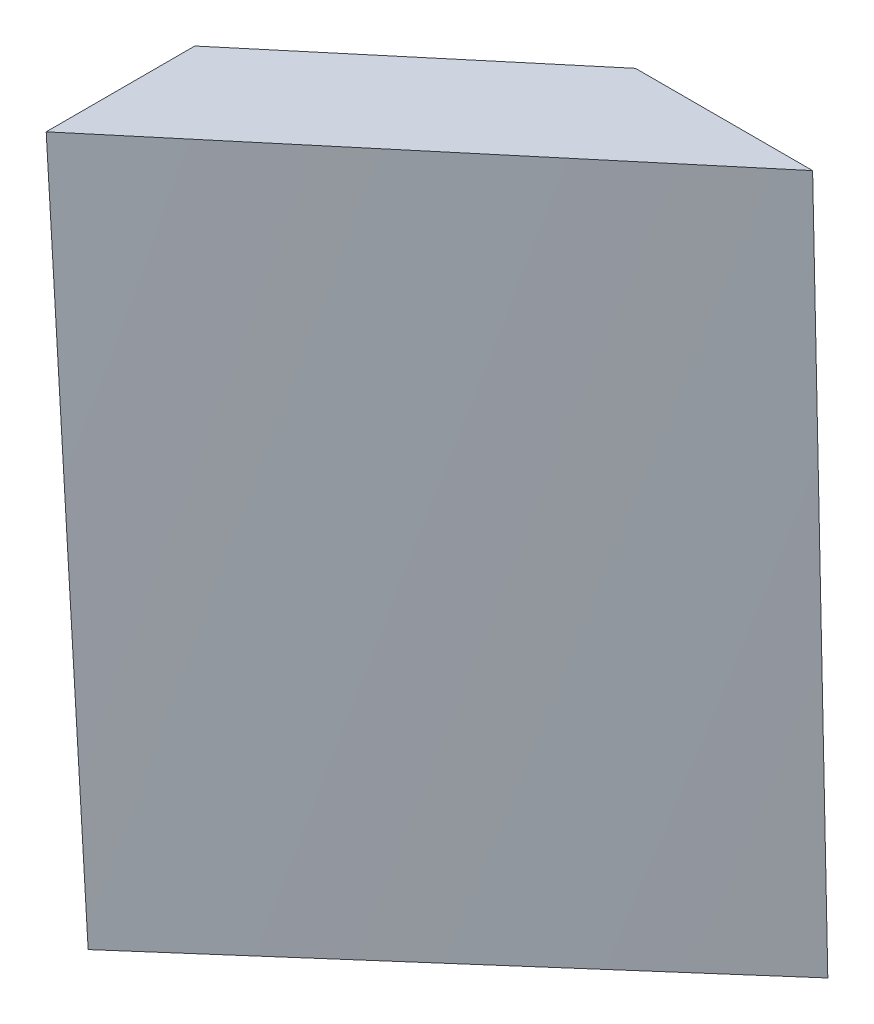
ISO-10303-21;
HEADER;
FILE_DESCRIPTION(('STEP AP214'),'2;1');
FILE_NAME('part.step','',(''),(''),'','','');
FILE_SCHEMA(('AUTOMOTIVE_DESIGN { 1 0 10303 214 1 1 1 1 }'));
ENDSEC;
DATA;
#1=APPLICATION_CONTEXT('core data for automotive mechanical design processes');
#2=APPLICATION_PROTOCOL_DEFINITION('international standard','automotive_design',2000,#1);
#3=PRODUCT_CONTEXT('',#1,'mechanical');
#4=PRODUCT('Part','Part','',(#3));
#5=PRODUCT_RELATED_PRODUCT_CATEGORY('part','',(#4));
#6=PRODUCT_DEFINITION_FORMATION('','',#4);
#7=PRODUCT_DEFINITION_CONTEXT('part definition',#1,'design');
#8=PRODUCT_DEFINITION('design','',#6,#7);
#9=PRODUCT_DEFINITION_SHAPE('','',#8);
#10=(LENGTH_UNIT() NAMED_UNIT(*) SI_UNIT(.MILLI.,.METRE.));
#11=(NAMED_UNIT(*) PLANE_ANGLE_UNIT() SI_UNIT($,.RADIAN.));
#12=(NAMED_UNIT(*) SI_UNIT($,.STERADIAN.) SOLID_ANGLE_UNIT());
#13=UNCERTAINTY_MEASURE_WITH_UNIT(LENGTH_MEASURE(1.E-05),#10,'distance_accuracy_value','');
#14=(GEOMETRIC_REPRESENTATION_CONTEXT(3) GLOBAL_UNCERTAINTY_ASSIGNED_CONTEXT((#13)) GLOBAL_UNIT_ASSIGNED_CONTEXT((#10,
#11,#12)) REPRESENTATION_CONTEXT('',''));
#15=CARTESIAN_POINT('',(0.,0.,0.));
#16=DIRECTION('',(0.,0.,1.));
#17=DIRECTION('',(1.,0.,0.));
#18=AXIS2_PLACEMENT_3D('',#15,#16,#17);
#19=CARTESIAN_POINT('',(0.,0.,0.));
#20=DIRECTION('',(0.,-1.,0.));
#21=DIRECTION('',(0.,0.,-1.));
#22=AXIS2_PLACEMENT_3D('',#19,#20,#21);
#23=PLANE('',#22);
#24=DIRECTION('',(0.752496437426902,0.,-0.658596319196988));
#25=VECTOR('',#24,1.);
#26=CARTESIAN_POINT('',(43.3136949382924,0.,-37.9088041329786));
#27=LINE('',#26,#25);
#28=CARTESIAN_POINT('',(0.,0.,0.));
#29=VERTEX_POINT('',#28);
#30=CARTESIAN_POINT('',(43.3136949382924,0.,-37.9088041329786));
#31=VERTEX_POINT('',#30);
#32=EDGE_CURVE('E106',#29,#31,#27,.T.);
#33=ORIENTED_EDGE('',*,*,#32,.F.);
#34=DIRECTION('',(0.,0.,1.));
#35=VECTOR('',#34,1.);
#36=CARTESIAN_POINT('',(0.,0.,0.));
#37=LINE('',#36,#35);
#38=CARTESIAN_POINT('',(0.,0.,-16.32));
#39=VERTEX_POINT('',#38);
#40=EDGE_CURVE('E198',#39,#29,#37,.T.);
#41=ORIENTED_EDGE('',*,*,#40,.F.);
#42=DIRECTION('',(-0.741569140406851,0.,0.67087644912923));
#43=VECTOR('',#42,1.);
#44=CARTESIAN_POINT('',(0.,0.,-16.32));
#45=LINE('',#44,#43);
#46=CARTESIAN_POINT('',(23.8636949382925,0.,-37.9088041329786));
#47=VERTEX_POINT('',#46);
#48=EDGE_CURVE('E64',#47,#39,#45,.T.);
#49=ORIENTED_EDGE('',*,*,#48,.F.);
#50=DIRECTION('',(-1.,0.,0.));
#51=VECTOR('',#50,1.);
#52=CARTESIAN_POINT('',(23.8636949382925,0.,-37.9088041329786));
#53=LINE('',#52,#51);
#54=EDGE_CURVE('E12',#31,#47,#53,.T.);
#55=ORIENTED_EDGE('',*,*,#54,.F.);
#56=EDGE_LOOP('',(#33,#41,#49,#55));
#57=FACE_BOUND('',#56,.T.);
#58=ADVANCED_FACE('F53',(#57),#23,.T.);
#59=CARTESIAN_POINT('',(0.,75.,0.));
#60=DIRECTION('',(0.,1.,0.));
#61=DIRECTION('',(0.,0.,1.));
#62=AXIS2_PLACEMENT_3D('',#59,#60,#61);
#63=PLANE('',#62);
#64=DIRECTION('',(-0.766210622457985,0.,0.642589512856028));
#65=VECTOR('',#64,1.);
#66=CARTESIAN_POINT('',(21.2436949382924,75.,-38.8588041329786));
#67=LINE('',#66,#65);
#68=CARTESIAN_POINT('',(21.2436949382924,75.,-38.8588041329786));
#69=VERTEX_POINT('',#68);
#70=CARTESIAN_POINT('',(-5.07563994313934,75.,-16.7858543663741));
#71=VERTEX_POINT('',#70);
#72=EDGE_CURVE('E169',#69,#71,#67,.T.);
#73=ORIENTED_EDGE('',*,*,#72,.T.);
#74=DIRECTION('',(0.,0.,1.));
#75=VECTOR('',#74,1.);
#76=CARTESIAN_POINT('',(-5.07563994313934,75.,-16.7858543663741));
#77=LINE('',#76,#75);
#78=CARTESIAN_POINT('',(-5.07563994313934,75.,-0.465854366374073));
#79=VERTEX_POINT('',#78);
#80=EDGE_CURVE('E125',#71,#79,#77,.T.);
#81=ORIENTED_EDGE('',*,*,#80,.T.);
#82=DIRECTION('',(0.766145304912993,0.,-0.642667388125286));
#83=VECTOR('',#82,1.);
#84=CARTESIAN_POINT('',(-5.07563994313934,75.,-0.465854366374073));
#85=LINE('',#84,#83);
#86=CARTESIAN_POINT('',(40.6938805723629,75.,-38.8588041329786));
#87=VERTEX_POINT('',#86);
#88=EDGE_CURVE('E103',#79,#87,#85,.T.);
#89=ORIENTED_EDGE('',*,*,#88,.T.);
#90=DIRECTION('',(-1.,0.,0.));
#91=VECTOR('',#90,1.);
#92=CARTESIAN_POINT('',(40.6938805723629,75.,-38.8588041329786));
#93=LINE('',#92,#91);
#94=EDGE_CURVE('E112',#87,#69,#93,.T.);
#95=ORIENTED_EDGE('',*,*,#94,.T.);
#96=EDGE_LOOP('',(#73,#81,#89,#95));
#97=FACE_BOUND('',#96,.T.);
#98=ADVANCED_FACE('F124',(#97),#63,.T.);
#99=CARTESIAN_POINT('',(-5.07563994313934,75.,-16.7858543663741));
#100=CARTESIAN_POINT('',(0.,0.,-16.32));
#101=CARTESIAN_POINT('',(-0.689084129567373,75.,-20.4646793274748));
#102=CARTESIAN_POINT('',(3.97728248971541,0.,-19.9181340221631));
#103=CARTESIAN_POINT('',(3.69747168400459,75.,-24.1435042885756));
#104=CARTESIAN_POINT('',(7.95456497943083,0.,-23.5162680443262));
#105=CARTESIAN_POINT('',(12.4705833111485,75.,-31.5011542107771));
#106=CARTESIAN_POINT('',(15.9091299588616,0.,-30.7125360886524));
#107=CARTESIAN_POINT('',(16.8571391247205,75.,-35.1799791718779));
#108=CARTESIAN_POINT('',(19.8864124485771,0.,-34.3106701108155));
#109=CARTESIAN_POINT('',(21.2436949382924,75.,-38.8588041329786));
#110=CARTESIAN_POINT('',(23.8636949382925,0.,-37.9088041329786));
#111=B_SPLINE_SURFACE_WITH_KNOTS('',3,1,((#99,#100),(#101,#102),(#103,#104),(#105,#106),(#107,
#108),(#109,#110)),.UNSPECIFIED.,.F.,.F.,.F.,(4,2,4),(2,2),(0.,0.5,1.),(0.,1.),.UNSPECIFIED.);
#112=DIRECTION('',(0.0349092406177446,-0.999310323027041,0.0126579307583425));
#113=VECTOR('',#112,1.);
#114=CARTESIAN_POINT('',(22.5536949382924,37.5,-38.3838041329786));
#115=LINE('',#114,#113);
#116=EDGE_CURVE('E79',#69,#47,#115,.T.);
#117=DIRECTION('',(-0.0675194590740028,0.997698711350691,-0.00619709734678005));
#118=VECTOR('',#117,1.);
#119=CARTESIAN_POINT('',(-2.53781997156967,37.5,-16.552927183187));
#120=LINE('',#119,#118);
#121=EDGE_CURVE('E119',#39,#71,#120,.T.);
#122=ORIENTED_EDGE('',*,*,#72,.F.);
#123=ORIENTED_EDGE('',*,*,#116,.T.);
#124=ORIENTED_EDGE('',*,*,#48,.T.);
#125=ORIENTED_EDGE('',*,*,#121,.T.);
#126=EDGE_LOOP('',(#122,#123,#124,#125));
#127=FACE_BOUND('',#126,.T.);
#128=ADVANCED_FACE('F145',(#127),#111,.T.);
#129=CARTESIAN_POINT('',(0.,-0.480101156121125,-37.9027228516678));
#130=DIRECTION('',(0.,-0.0126656506407787,-0.999919787429895));
#131=DIRECTION('',(0.,0.999919787429895,-0.0126656506407787));
#132=AXIS2_PLACEMENT_3D('',#129,#130,#131);
#133=PLANE('',#132);
#134=DIRECTION('',(0.0349067702177578,-0.999310409309447,0.012657931851253));
#135=VECTOR('',#134,1.);
#136=CARTESIAN_POINT('',(40.6938805723629,75.,-38.8588041329786));
#137=LINE('',#136,#135);
#138=EDGE_CURVE('E98',#87,#31,#137,.T.);
#139=ORIENTED_EDGE('',*,*,#138,.T.);
#140=ORIENTED_EDGE('',*,*,#54,.T.);
#141=ORIENTED_EDGE('',*,*,#116,.F.);
#142=ORIENTED_EDGE('',*,*,#94,.F.);
#143=EDGE_LOOP('',(#139,#140,#141,#142));
#144=FACE_BOUND('',#143,.T.);
#145=ADVANCED_FACE('F114',(#144),#133,.T.);
#146=CARTESIAN_POINT('',(0.,0.,0.));
#147=DIRECTION('',(-0.997717869720911,-0.0675207556205246,0.));
#148=DIRECTION('',(0.0675207556205246,-0.997717869720911,0.));
#149=AXIS2_PLACEMENT_3D('',#146,#147,#148);
#150=PLANE('',#149);
#151=ORIENTED_EDGE('',*,*,#121,.F.);
#152=ORIENTED_EDGE('',*,*,#40,.T.);
#153=DIRECTION('',(0.0675194590740028,-0.997698711350691,0.00619709734677998));
#154=VECTOR('',#153,1.);
#155=CARTESIAN_POINT('',(-2.53781997156967,37.5,-0.23292718318704));
#156=LINE('',#155,#154);
#157=EDGE_CURVE('E110',#79,#29,#156,.T.);
#158=ORIENTED_EDGE('',*,*,#157,.F.);
#159=ORIENTED_EDGE('',*,*,#80,.F.);
#160=EDGE_LOOP('',(#151,#152,#158,#159));
#161=FACE_BOUND('',#160,.T.);
#162=ADVANCED_FACE('F232',(#161),#150,.T.);
#163=CARTESIAN_POINT('',(40.6938805723629,75.,-38.8588041329786));
#164=CARTESIAN_POINT('',(43.3136949382924,0.,-37.9088041329786));
#165=CARTESIAN_POINT('',(33.0656271531125,75.,-32.4599791718778));
#166=CARTESIAN_POINT('',(36.0947457819104,0.,-31.5906701108156));
#167=CARTESIAN_POINT('',(25.4373737338621,75.,-26.0611542107771));
#168=CARTESIAN_POINT('',(28.8757966255284,0.,-25.2725360886525));
#169=CARTESIAN_POINT('',(10.1808668953613,75.,-13.2635042885755));
#170=CARTESIAN_POINT('',(14.4378983127642,0.,-12.6362680443263));
#171=CARTESIAN_POINT('',(2.55261347611099,75.,-6.8646793274748));
#172=CARTESIAN_POINT('',(7.21894915638211,0.,-6.31813402216314));
#173=CARTESIAN_POINT('',(-5.07563994313934,75.,-0.465854366374073));
#174=CARTESIAN_POINT('',(0.,0.,0.));
#175=B_SPLINE_SURFACE_WITH_KNOTS('',3,1,((#163,#164),(#165,#166),(#167,#168),(#169,#170),(#171,
#172),(#173,#174)),.UNSPECIFIED.,.F.,.F.,.F.,(4,2,4),(2,2),(0.,0.5,1.),(0.,1.),.UNSPECIFIED.);
#176=ORIENTED_EDGE('',*,*,#88,.F.);
#177=ORIENTED_EDGE('',*,*,#157,.T.);
#178=ORIENTED_EDGE('',*,*,#32,.T.);
#179=ORIENTED_EDGE('',*,*,#138,.F.);
#180=EDGE_LOOP('',(#176,#177,#178,#179));
#181=FACE_BOUND('',#180,.T.);
#182=ADVANCED_FACE('F100',(#181),#175,.T.);
#183=CLOSED_SHELL('',(#58,#98,#128,#145,#162,#182));
#184=MANIFOLD_SOLID_BREP('B2',#183);
#185=ADVANCED_BREP_SHAPE_REPRESENTATION('',(#18,#184),#14);
#186=SHAPE_DEFINITION_REPRESENTATION(#9,#185);
ENDSEC;
END-ISO-10303-21;
